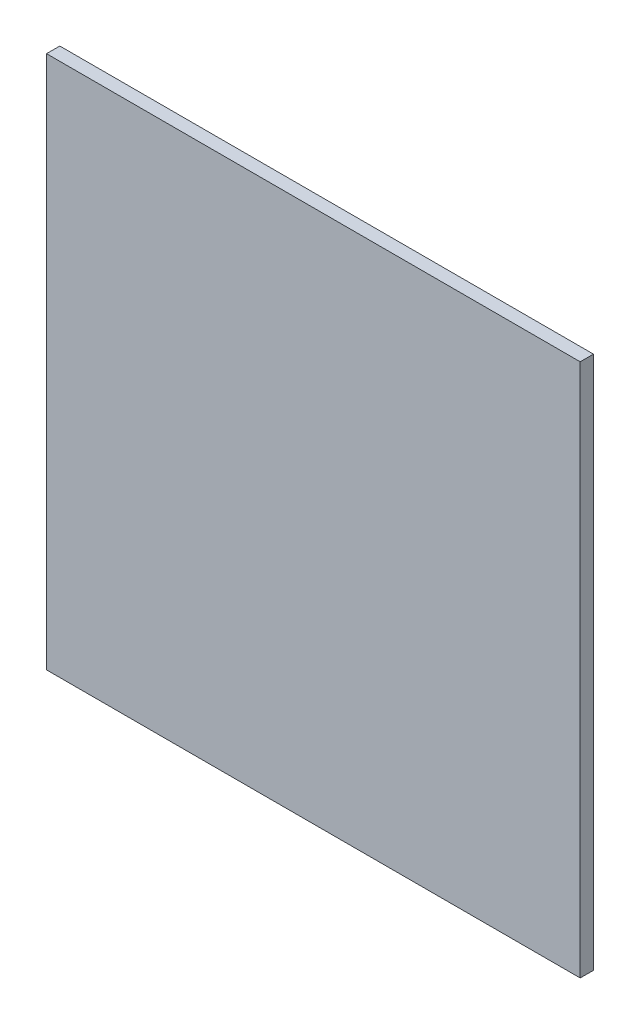
ISO-10303-21;
HEADER;
FILE_DESCRIPTION(('STEP AP214'),'2;1');
FILE_NAME('part.step','',(''),(''),'','','');
FILE_SCHEMA(('AUTOMOTIVE_DESIGN { 1 0 10303 214 1 1 1 1 }'));
ENDSEC;
DATA;
#1=APPLICATION_CONTEXT('core data for automotive mechanical design processes');
#2=APPLICATION_PROTOCOL_DEFINITION('international standard','automotive_design',2000,#1);
#3=PRODUCT_CONTEXT('',#1,'mechanical');
#4=PRODUCT('Part','Part','',(#3));
#5=PRODUCT_RELATED_PRODUCT_CATEGORY('part','',(#4));
#6=PRODUCT_DEFINITION_FORMATION('','',#4);
#7=PRODUCT_DEFINITION_CONTEXT('part definition',#1,'design');
#8=PRODUCT_DEFINITION('design','',#6,#7);
#9=PRODUCT_DEFINITION_SHAPE('','',#8);
#10=(LENGTH_UNIT() NAMED_UNIT(*) SI_UNIT(.MILLI.,.METRE.));
#11=(NAMED_UNIT(*) PLANE_ANGLE_UNIT() SI_UNIT($,.RADIAN.));
#12=(NAMED_UNIT(*) SI_UNIT($,.STERADIAN.) SOLID_ANGLE_UNIT());
#13=UNCERTAINTY_MEASURE_WITH_UNIT(LENGTH_MEASURE(1.E-05),#10,'distance_accuracy_value','');
#14=(GEOMETRIC_REPRESENTATION_CONTEXT(3) GLOBAL_UNCERTAINTY_ASSIGNED_CONTEXT((#13)) GLOBAL_UNIT_ASSIGNED_CONTEXT((#10,
#11,#12)) REPRESENTATION_CONTEXT('',''));
#15=CARTESIAN_POINT('',(0.,0.,0.));
#16=DIRECTION('',(0.,0.,1.));
#17=DIRECTION('',(1.,0.,0.));
#18=AXIS2_PLACEMENT_3D('',#15,#16,#17);
#19=CARTESIAN_POINT('',(63.881,-63.881,3.175));
#20=DIRECTION('',(-1.,0.,0.));
#21=DIRECTION('',(0.,0.,1.));
#22=AXIS2_PLACEMENT_3D('',#19,#20,#21);
#23=PLANE('',#22);
#24=DIRECTION('',(0.,1.,0.));
#25=VECTOR('',#24,1.);
#26=CARTESIAN_POINT('',(63.881,-63.881,0.));
#27=LINE('',#26,#25);
#28=CARTESIAN_POINT('',(63.881,-63.881,0.));
#29=VERTEX_POINT('',#28);
#30=CARTESIAN_POINT('',(63.881,63.881,0.));
#31=VERTEX_POINT('',#30);
#32=EDGE_CURVE('E96',#29,#31,#27,.T.);
#33=ORIENTED_EDGE('',*,*,#32,.T.);
#34=DIRECTION('',(0.,0.,-1.));
#35=VECTOR('',#34,1.);
#36=CARTESIAN_POINT('',(63.881,63.881,3.175));
#37=LINE('',#36,#35);
#38=CARTESIAN_POINT('',(63.881,63.881,3.175));
#39=VERTEX_POINT('',#38);
#40=EDGE_CURVE('E11',#39,#31,#37,.T.);
#41=ORIENTED_EDGE('',*,*,#40,.F.);
#42=DIRECTION('',(0.,1.,0.));
#43=VECTOR('',#42,1.);
#44=CARTESIAN_POINT('',(63.881,-63.881,3.175));
#45=LINE('',#44,#43);
#46=CARTESIAN_POINT('',(63.881,-63.881,3.175));
#47=VERTEX_POINT('',#46);
#48=EDGE_CURVE('E84',#47,#39,#45,.T.);
#49=ORIENTED_EDGE('',*,*,#48,.F.);
#50=DIRECTION('',(0.,0.,-1.));
#51=VECTOR('',#50,1.);
#52=CARTESIAN_POINT('',(63.881,-63.881,3.175));
#53=LINE('',#52,#51);
#54=EDGE_CURVE('E92',#47,#29,#53,.T.);
#55=ORIENTED_EDGE('',*,*,#54,.T.);
#56=EDGE_LOOP('',(#33,#41,#49,#55));
#57=FACE_BOUND('',#56,.T.);
#58=ADVANCED_FACE('F33',(#57),#23,.F.);
#59=CARTESIAN_POINT('',(-63.881,63.881,3.175));
#60=DIRECTION('',(0.,-1.,0.));
#61=DIRECTION('',(0.,0.,-1.));
#62=AXIS2_PLACEMENT_3D('',#59,#60,#61);
#63=PLANE('',#62);
#64=DIRECTION('',(-1.,0.,0.));
#65=VECTOR('',#64,1.);
#66=CARTESIAN_POINT('',(-63.881,63.881,0.));
#67=LINE('',#66,#65);
#68=CARTESIAN_POINT('',(-63.881,63.881,0.));
#69=VERTEX_POINT('',#68);
#70=EDGE_CURVE('E88',#31,#69,#67,.T.);
#71=ORIENTED_EDGE('',*,*,#70,.T.);
#72=DIRECTION('',(0.,0.,-1.));
#73=VECTOR('',#72,1.);
#74=CARTESIAN_POINT('',(-63.881,63.881,3.175));
#75=LINE('',#74,#73);
#76=CARTESIAN_POINT('',(-63.881,63.881,3.175));
#77=VERTEX_POINT('',#76);
#78=EDGE_CURVE('E41',#77,#69,#75,.T.);
#79=ORIENTED_EDGE('',*,*,#78,.F.);
#80=DIRECTION('',(-1.,0.,0.));
#81=VECTOR('',#80,1.);
#82=CARTESIAN_POINT('',(-63.881,63.881,3.175));
#83=LINE('',#82,#81);
#84=EDGE_CURVE('E79',#39,#77,#83,.T.);
#85=ORIENTED_EDGE('',*,*,#84,.F.);
#86=ORIENTED_EDGE('',*,*,#40,.T.);
#87=EDGE_LOOP('',(#71,#79,#85,#86));
#88=FACE_BOUND('',#87,.T.);
#89=ADVANCED_FACE('F87',(#88),#63,.F.);
#90=CARTESIAN_POINT('',(-63.881,-63.881,3.175));
#91=DIRECTION('',(1.,0.,0.));
#92=DIRECTION('',(0.,0.,-1.));
#93=AXIS2_PLACEMENT_3D('',#90,#91,#92);
#94=PLANE('',#93);
#95=DIRECTION('',(0.,-1.,0.));
#96=VECTOR('',#95,1.);
#97=CARTESIAN_POINT('',(-63.881,-63.881,0.));
#98=LINE('',#97,#96);
#99=CARTESIAN_POINT('',(-63.881,-63.881,0.));
#100=VERTEX_POINT('',#99);
#101=EDGE_CURVE('E66',#69,#100,#98,.T.);
#102=ORIENTED_EDGE('',*,*,#101,.T.);
#103=DIRECTION('',(0.,0.,-1.));
#104=VECTOR('',#103,1.);
#105=CARTESIAN_POINT('',(-63.881,-63.881,3.175));
#106=LINE('',#105,#104);
#107=CARTESIAN_POINT('',(-63.881,-63.881,3.175));
#108=VERTEX_POINT('',#107);
#109=EDGE_CURVE('E89',#108,#100,#106,.T.);
#110=ORIENTED_EDGE('',*,*,#109,.F.);
#111=DIRECTION('',(0.,-1.,0.));
#112=VECTOR('',#111,1.);
#113=CARTESIAN_POINT('',(-63.881,-63.881,3.175));
#114=LINE('',#113,#112);
#115=EDGE_CURVE('E82',#77,#108,#114,.T.);
#116=ORIENTED_EDGE('',*,*,#115,.F.);
#117=ORIENTED_EDGE('',*,*,#78,.T.);
#118=EDGE_LOOP('',(#102,#110,#116,#117));
#119=FACE_BOUND('',#118,.T.);
#120=ADVANCED_FACE('F90',(#119),#94,.F.);
#121=CARTESIAN_POINT('',(-63.881,-63.881,3.175));
#122=DIRECTION('',(0.,1.,0.));
#123=DIRECTION('',(0.,0.,1.));
#124=AXIS2_PLACEMENT_3D('',#121,#122,#123);
#125=PLANE('',#124);
#126=DIRECTION('',(1.,0.,0.));
#127=VECTOR('',#126,1.);
#128=CARTESIAN_POINT('',(-63.881,-63.881,0.));
#129=LINE('',#128,#127);
#130=EDGE_CURVE('E72',#100,#29,#129,.T.);
#131=ORIENTED_EDGE('',*,*,#130,.T.);
#132=ORIENTED_EDGE('',*,*,#54,.F.);
#133=DIRECTION('',(1.,0.,0.));
#134=VECTOR('',#133,1.);
#135=CARTESIAN_POINT('',(-63.881,-63.881,3.175));
#136=LINE('',#135,#134);
#137=EDGE_CURVE('E49',#108,#47,#136,.T.);
#138=ORIENTED_EDGE('',*,*,#137,.F.);
#139=ORIENTED_EDGE('',*,*,#109,.T.);
#140=EDGE_LOOP('',(#131,#132,#138,#139));
#141=FACE_BOUND('',#140,.T.);
#142=ADVANCED_FACE('F103',(#141),#125,.F.);
#143=CARTESIAN_POINT('',(0.,0.,3.175));
#144=DIRECTION('',(0.,0.,-1.));
#145=DIRECTION('',(-1.,0.,0.));
#146=AXIS2_PLACEMENT_3D('',#143,#144,#145);
#147=PLANE('',#146);
#148=ORIENTED_EDGE('',*,*,#48,.T.);
#149=ORIENTED_EDGE('',*,*,#84,.T.);
#150=ORIENTED_EDGE('',*,*,#115,.T.);
#151=ORIENTED_EDGE('',*,*,#137,.T.);
#152=EDGE_LOOP('',(#148,#149,#150,#151));
#153=FACE_BOUND('',#152,.T.);
#154=ADVANCED_FACE('F80',(#153),#147,.F.);
#155=CARTESIAN_POINT('',(0.,0.,0.));
#156=DIRECTION('',(0.,0.,-1.));
#157=DIRECTION('',(-1.,0.,0.));
#158=AXIS2_PLACEMENT_3D('',#155,#156,#157);
#159=PLANE('',#158);
#160=ORIENTED_EDGE('',*,*,#32,.F.);
#161=ORIENTED_EDGE('',*,*,#130,.F.);
#162=ORIENTED_EDGE('',*,*,#101,.F.);
#163=ORIENTED_EDGE('',*,*,#70,.F.);
#164=EDGE_LOOP('',(#160,#161,#162,#163));
#165=FACE_BOUND('',#164,.T.);
#166=ADVANCED_FACE('F106',(#165),#159,.T.);
#167=CLOSED_SHELL('',(#58,#89,#120,#142,#154,#166));
#168=MANIFOLD_SOLID_BREP('B2',#167);
#169=ADVANCED_BREP_SHAPE_REPRESENTATION('',(#18,#168),#14);
#170=SHAPE_DEFINITION_REPRESENTATION(#9,#169);
ENDSEC;
END-ISO-10303-21;
